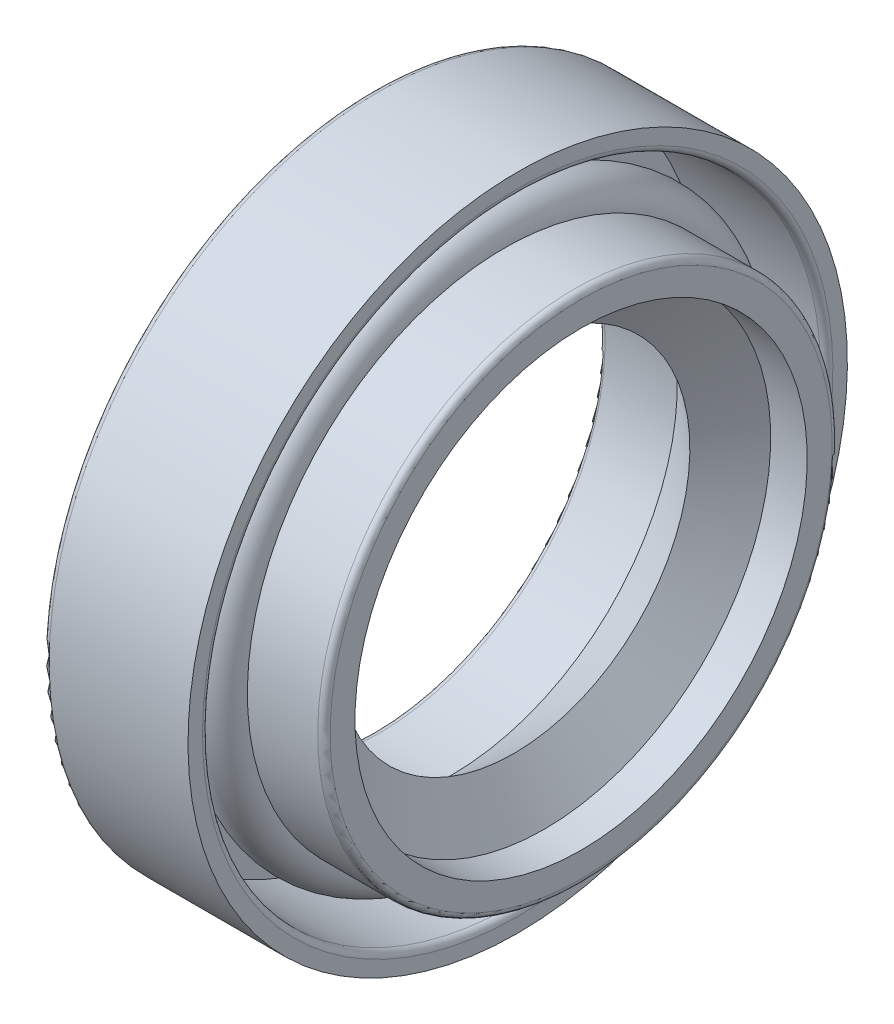
ISO-10303-21;
HEADER;
FILE_DESCRIPTION(('STEP AP214'),'2;1');
FILE_NAME('part.step','',(''),(''),'','','');
FILE_SCHEMA(('AUTOMOTIVE_DESIGN { 1 0 10303 214 1 1 1 1 }'));
ENDSEC;
DATA;
#1=APPLICATION_CONTEXT('core data for automotive mechanical design processes');
#2=APPLICATION_PROTOCOL_DEFINITION('international standard','automotive_design',2000,#1);
#3=PRODUCT_CONTEXT('',#1,'mechanical');
#4=PRODUCT('Part','Part','',(#3));
#5=PRODUCT_RELATED_PRODUCT_CATEGORY('part','',(#4));
#6=PRODUCT_DEFINITION_FORMATION('','',#4);
#7=PRODUCT_DEFINITION_CONTEXT('part definition',#1,'design');
#8=PRODUCT_DEFINITION('design','',#6,#7);
#9=PRODUCT_DEFINITION_SHAPE('','',#8);
#10=(LENGTH_UNIT() NAMED_UNIT(*) SI_UNIT(.MILLI.,.METRE.));
#11=(NAMED_UNIT(*) PLANE_ANGLE_UNIT() SI_UNIT($,.RADIAN.));
#12=(NAMED_UNIT(*) SI_UNIT($,.STERADIAN.) SOLID_ANGLE_UNIT());
#13=UNCERTAINTY_MEASURE_WITH_UNIT(LENGTH_MEASURE(1.E-05),#10,'distance_accuracy_value','');
#14=(GEOMETRIC_REPRESENTATION_CONTEXT(3) GLOBAL_UNCERTAINTY_ASSIGNED_CONTEXT((#13)) GLOBAL_UNIT_ASSIGNED_CONTEXT((#10,
#11,#12)) REPRESENTATION_CONTEXT('',''));
#15=CARTESIAN_POINT('',(0.,0.,0.));
#16=DIRECTION('',(0.,0.,1.));
#17=DIRECTION('',(1.,0.,0.));
#18=AXIS2_PLACEMENT_3D('',#15,#16,#17);
#19=CARTESIAN_POINT('',(3.79351798729761,0.,0.));
#20=DIRECTION('',(-1.,0.,0.));
#21=DIRECTION('',(0.,-1.,0.));
#22=AXIS2_PLACEMENT_3D('',#19,#20,#21);
#23=CONICAL_SURFACE('',#22,10.9140500939635,0.674740942223552);
#24=CARTESIAN_POINT('',(6.81108060475203,0.,0.));
#25=DIRECTION('',(-1.,0.,0.));
#26=DIRECTION('',(0.,-1.,0.));
#27=AXIS2_PLACEMENT_3D('',#24,#25,#26);
#28=CIRCLE('',#27,8.5);
#29=CARTESIAN_POINT('',(6.81108060475203,-8.5,0.));
#30=VERTEX_POINT('',#29);
#31=EDGE_CURVE('E10',#30,#30,#28,.T.);
#32=ORIENTED_EDGE('',*,*,#31,.F.);
#33=EDGE_LOOP('',(#32));
#34=FACE_BOUND('',#33,.T.);
#35=CARTESIAN_POINT('',(3.79351798729761,0.,0.));
#36=DIRECTION('',(-1.,0.,0.));
#37=DIRECTION('',(0.,-1.,0.));
#38=AXIS2_PLACEMENT_3D('',#35,#36,#37);
#39=CIRCLE('',#38,10.9140500939635);
#40=CARTESIAN_POINT('',(3.79351798729761,-10.9140500939635,0.));
#41=VERTEX_POINT('',#40);
#42=EDGE_CURVE('E92',#41,#41,#39,.T.);
#43=ORIENTED_EDGE('',*,*,#42,.T.);
#44=EDGE_LOOP('',(#43));
#45=FACE_BOUND('',#44,.T.);
#46=ADVANCED_FACE('F37',(#34,#45),#23,.F.);
#47=CARTESIAN_POINT('',(6.81108060475203,0.,0.));
#48=DIRECTION('',(1.,0.,0.));
#49=DIRECTION('',(0.,1.,0.));
#50=AXIS2_PLACEMENT_3D('',#47,#48,#49);
#51=CONICAL_SURFACE('',#50,8.5,1.01914134426635);
#52=CARTESIAN_POINT('',(8.29664989334498,0.,0.));
#53=DIRECTION('',(-1.,0.,0.));
#54=DIRECTION('',(0.,-1.,0.));
#55=AXIS2_PLACEMENT_3D('',#52,#53,#54);
#56=CIRCLE('',#55,10.9140500939635);
#57=CARTESIAN_POINT('',(8.29664989334498,-10.9140500939635,0.));
#58=VERTEX_POINT('',#57);
#59=EDGE_CURVE('E43',#58,#58,#56,.T.);
#60=ORIENTED_EDGE('',*,*,#59,.F.);
#61=EDGE_LOOP('',(#60));
#62=FACE_BOUND('',#61,.T.);
#63=ORIENTED_EDGE('',*,*,#31,.T.);
#64=EDGE_LOOP('',(#63));
#65=FACE_BOUND('',#64,.T.);
#66=ADVANCED_FACE('F183',(#62,#65),#51,.F.);
#67=CARTESIAN_POINT('',(0.,0.,0.));
#68=DIRECTION('',(-1.,0.,0.));
#69=DIRECTION('',(0.,-1.,0.));
#70=AXIS2_PLACEMENT_3D('',#67,#68,#69);
#71=CYLINDRICAL_SURFACE('',#70,10.9140500939635);
#72=CARTESIAN_POINT('',(10.0607634235491,0.,0.));
#73=DIRECTION('',(-1.,0.,0.));
#74=DIRECTION('',(0.,-1.,0.));
#75=AXIS2_PLACEMENT_3D('',#72,#73,#74);
#76=CIRCLE('',#75,10.9140500939635);
#77=CARTESIAN_POINT('',(10.0607634235491,-10.9140500939635,0.));
#78=VERTEX_POINT('',#77);
#79=EDGE_CURVE('E47',#78,#78,#76,.T.);
#80=ORIENTED_EDGE('',*,*,#79,.F.);
#81=EDGE_LOOP('',(#80));
#82=FACE_BOUND('',#81,.T.);
#83=ORIENTED_EDGE('',*,*,#59,.T.);
#84=EDGE_LOOP('',(#83));
#85=FACE_BOUND('',#84,.T.);
#86=ADVANCED_FACE('F178',(#82,#85),#71,.F.);
#87=CARTESIAN_POINT('',(10.0607634235491,10.9140500939635,0.));
#88=DIRECTION('',(-1.,0.,0.));
#89=DIRECTION('',(0.,-1.,0.));
#90=AXIS2_PLACEMENT_3D('',#87,#88,#89);
#91=PLANE('',#90);
#92=CARTESIAN_POINT('',(10.0607634235491,0.,0.));
#93=DIRECTION('',(-1.,0.,0.));
#94=DIRECTION('',(0.,-1.,0.));
#95=AXIS2_PLACEMENT_3D('',#92,#93,#94);
#96=CIRCLE('',#95,12.1140500939635);
#97=CARTESIAN_POINT('',(10.0607634235491,-12.1140500939635,0.));
#98=VERTEX_POINT('',#97);
#99=EDGE_CURVE('E51',#98,#98,#96,.T.);
#100=ORIENTED_EDGE('',*,*,#99,.F.);
#101=EDGE_LOOP('',(#100));
#102=FACE_BOUND('',#101,.T.);
#103=ORIENTED_EDGE('',*,*,#79,.T.);
#104=EDGE_LOOP('',(#103));
#105=FACE_BOUND('',#104,.T.);
#106=ADVANCED_FACE('F172',(#102,#105),#91,.F.);
#107=CARTESIAN_POINT('',(9.76076342354911,0.,0.));
#108=DIRECTION('',(-1.,0.,0.));
#109=DIRECTION('',(0.,-1.,0.));
#110=AXIS2_PLACEMENT_3D('',#107,#108,#109);
#111=TOROIDAL_SURFACE('',#110,12.1140500939635,0.3);
#112=CARTESIAN_POINT('',(9.7607634235491,0.,0.));
#113=DIRECTION('',(-1.,0.,0.));
#114=DIRECTION('',(0.,-1.,0.));
#115=AXIS2_PLACEMENT_3D('',#112,#113,#114);
#116=CIRCLE('',#115,12.4140500939635);
#117=CARTESIAN_POINT('',(9.7607634235491,-12.4140500939635,0.));
#118=VERTEX_POINT('',#117);
#119=EDGE_CURVE('E56',#118,#118,#116,.T.);
#120=ORIENTED_EDGE('',*,*,#119,.F.);
#121=EDGE_LOOP('',(#120));
#122=FACE_BOUND('',#121,.T.);
#123=ORIENTED_EDGE('',*,*,#99,.T.);
#124=EDGE_LOOP('',(#123));
#125=FACE_BOUND('',#124,.T.);
#126=ADVANCED_FACE('F166',(#122,#125),#111,.T.);
#127=CARTESIAN_POINT('',(0.,0.,0.));
#128=DIRECTION('',(-1.,0.,0.));
#129=DIRECTION('',(0.,-1.,0.));
#130=AXIS2_PLACEMENT_3D('',#127,#128,#129);
#131=CYLINDRICAL_SURFACE('',#130,12.4140500939635);
#132=CARTESIAN_POINT('',(6.36550708989647,0.,0.));
#133=DIRECTION('',(-1.,0.,0.));
#134=DIRECTION('',(0.,-1.,0.));
#135=AXIS2_PLACEMENT_3D('',#132,#133,#134);
#136=CIRCLE('',#135,12.4140500939635);
#137=CARTESIAN_POINT('',(6.36550708989647,-12.4140500939635,0.));
#138=VERTEX_POINT('',#137);
#139=EDGE_CURVE('E59',#138,#138,#136,.T.);
#140=ORIENTED_EDGE('',*,*,#139,.F.);
#141=EDGE_LOOP('',(#140));
#142=FACE_BOUND('',#141,.T.);
#143=ORIENTED_EDGE('',*,*,#119,.T.);
#144=EDGE_LOOP('',(#143));
#145=FACE_BOUND('',#144,.T.);
#146=ADVANCED_FACE('F160',(#142,#145),#131,.T.);
#147=CARTESIAN_POINT('',(5.07951253859704,0.,0.));
#148=DIRECTION('',(-1.,0.,0.));
#149=DIRECTION('',(0.,-1.,0.));
#150=AXIS2_PLACEMENT_3D('',#147,#148,#149);
#151=TOROIDAL_SURFACE('',#150,12.4140500939635,1.28599455129943);
#152=CARTESIAN_POINT('',(3.79351798729761,0.,0.));
#153=DIRECTION('',(-1.,0.,0.));
#154=DIRECTION('',(0.,-1.,0.));
#155=AXIS2_PLACEMENT_3D('',#152,#153,#154);
#156=CIRCLE('',#155,12.4140500939635);
#157=CARTESIAN_POINT('',(3.79351798729761,-12.4140500939635,0.));
#158=VERTEX_POINT('',#157);
#159=EDGE_CURVE('E62',#158,#158,#156,.T.);
#160=ORIENTED_EDGE('',*,*,#159,.F.);
#161=EDGE_LOOP('',(#160));
#162=FACE_BOUND('',#161,.T.);
#163=ORIENTED_EDGE('',*,*,#139,.T.);
#164=EDGE_LOOP('',(#163));
#165=FACE_BOUND('',#164,.T.);
#166=ADVANCED_FACE('F154',(#162,#165),#151,.T.);
#167=CARTESIAN_POINT('',(0.,0.,0.));
#168=DIRECTION('',(-1.,0.,0.));
#169=DIRECTION('',(0.,-1.,0.));
#170=AXIS2_PLACEMENT_3D('',#167,#168,#169);
#171=CYLINDRICAL_SURFACE('',#170,12.4140500939635);
#172=CARTESIAN_POINT('',(1.,0.,0.));
#173=DIRECTION('',(-1.,0.,0.));
#174=DIRECTION('',(0.,-1.,0.));
#175=AXIS2_PLACEMENT_3D('',#172,#173,#174);
#176=CIRCLE('',#175,12.4140500939635);
#177=CARTESIAN_POINT('',(1.,-12.4140500939635,0.));
#178=VERTEX_POINT('',#177);
#179=EDGE_CURVE('E65',#178,#178,#176,.T.);
#180=ORIENTED_EDGE('',*,*,#179,.F.);
#181=EDGE_LOOP('',(#180));
#182=FACE_BOUND('',#181,.T.);
#183=ORIENTED_EDGE('',*,*,#159,.T.);
#184=EDGE_LOOP('',(#183));
#185=FACE_BOUND('',#184,.T.);
#186=ADVANCED_FACE('F148',(#182,#185),#171,.T.);
#187=CARTESIAN_POINT('',(1.,12.4140500939635,0.));
#188=DIRECTION('',(-1.,0.,0.));
#189=DIRECTION('',(0.,-1.,0.));
#190=AXIS2_PLACEMENT_3D('',#187,#188,#189);
#191=PLANE('',#190);
#192=CARTESIAN_POINT('',(1.,0.,0.));
#193=DIRECTION('',(-1.,0.,0.));
#194=DIRECTION('',(0.,-1.,0.));
#195=AXIS2_PLACEMENT_3D('',#192,#193,#194);
#196=CIRCLE('',#195,14.9140500939635);
#197=CARTESIAN_POINT('',(1.,-14.9140500939635,0.));
#198=VERTEX_POINT('',#197);
#199=EDGE_CURVE('E68',#198,#198,#196,.T.);
#200=ORIENTED_EDGE('',*,*,#199,.F.);
#201=EDGE_LOOP('',(#200));
#202=FACE_BOUND('',#201,.T.);
#203=ORIENTED_EDGE('',*,*,#179,.T.);
#204=EDGE_LOOP('',(#203));
#205=FACE_BOUND('',#204,.T.);
#206=ADVANCED_FACE('F142',(#202,#205),#191,.F.);
#207=CARTESIAN_POINT('',(0.,0.,0.));
#208=DIRECTION('',(-1.,0.,0.));
#209=DIRECTION('',(0.,-1.,0.));
#210=AXIS2_PLACEMENT_3D('',#207,#208,#209);
#211=CYLINDRICAL_SURFACE('',#210,14.9140500939635);
#212=CARTESIAN_POINT('',(6.7,0.,0.));
#213=DIRECTION('',(-1.,0.,0.));
#214=DIRECTION('',(0.,-1.,0.));
#215=AXIS2_PLACEMENT_3D('',#212,#213,#214);
#216=CIRCLE('',#215,14.9140500939635);
#217=CARTESIAN_POINT('',(6.7,-14.9140500939635,0.));
#218=VERTEX_POINT('',#217);
#219=EDGE_CURVE('E71',#218,#218,#216,.T.);
#220=ORIENTED_EDGE('',*,*,#219,.F.);
#221=EDGE_LOOP('',(#220));
#222=FACE_BOUND('',#221,.T.);
#223=ORIENTED_EDGE('',*,*,#199,.T.);
#224=EDGE_LOOP('',(#223));
#225=FACE_BOUND('',#224,.T.);
#226=ADVANCED_FACE('F136',(#222,#225),#211,.F.);
#227=CARTESIAN_POINT('',(6.7,0.,0.));
#228=DIRECTION('',(-1.,0.,0.));
#229=DIRECTION('',(0.,-1.,0.));
#230=AXIS2_PLACEMENT_3D('',#227,#228,#229);
#231=TOROIDAL_SURFACE('',#230,15.2140500939635,0.3);
#232=CARTESIAN_POINT('',(7.,0.,0.));
#233=DIRECTION('',(-1.,0.,0.));
#234=DIRECTION('',(0.,-1.,0.));
#235=AXIS2_PLACEMENT_3D('',#232,#233,#234);
#236=CIRCLE('',#235,15.2140500939635);
#237=CARTESIAN_POINT('',(7.,-15.2140500939635,0.));
#238=VERTEX_POINT('',#237);
#239=EDGE_CURVE('E74',#238,#238,#236,.T.);
#240=ORIENTED_EDGE('',*,*,#239,.F.);
#241=EDGE_LOOP('',(#240));
#242=FACE_BOUND('',#241,.T.);
#243=ORIENTED_EDGE('',*,*,#219,.T.);
#244=EDGE_LOOP('',(#243));
#245=FACE_BOUND('',#244,.T.);
#246=ADVANCED_FACE('F130',(#242,#245),#231,.T.);
#247=CARTESIAN_POINT('',(7.,15.2140500939635,0.));
#248=DIRECTION('',(-1.,0.,0.));
#249=DIRECTION('',(0.,-1.,0.));
#250=AXIS2_PLACEMENT_3D('',#247,#248,#249);
#251=PLANE('',#250);
#252=CARTESIAN_POINT('',(7.,0.,0.));
#253=DIRECTION('',(-1.,0.,0.));
#254=DIRECTION('',(0.,-1.,0.));
#255=AXIS2_PLACEMENT_3D('',#252,#253,#254);
#256=CIRCLE('',#255,15.9140500939635);
#257=CARTESIAN_POINT('',(7.,-15.9140500939635,0.));
#258=VERTEX_POINT('',#257);
#259=EDGE_CURVE('E77',#258,#258,#256,.T.);
#260=ORIENTED_EDGE('',*,*,#259,.F.);
#261=EDGE_LOOP('',(#260));
#262=FACE_BOUND('',#261,.T.);
#263=ORIENTED_EDGE('',*,*,#239,.T.);
#264=EDGE_LOOP('',(#263));
#265=FACE_BOUND('',#264,.T.);
#266=ADVANCED_FACE('F124',(#262,#265),#251,.F.);
#267=CARTESIAN_POINT('',(0.,0.,0.));
#268=DIRECTION('',(-1.,0.,0.));
#269=DIRECTION('',(0.,-1.,0.));
#270=AXIS2_PLACEMENT_3D('',#267,#268,#269);
#271=CYLINDRICAL_SURFACE('',#270,15.9140500939635);
#272=CARTESIAN_POINT('',(0.300000000000002,0.,0.));
#273=DIRECTION('',(-1.,0.,0.));
#274=DIRECTION('',(0.,-1.,0.));
#275=AXIS2_PLACEMENT_3D('',#272,#273,#274);
#276=CIRCLE('',#275,15.9140500939635);
#277=CARTESIAN_POINT('',(0.300000000000002,-15.9140500939635,0.));
#278=VERTEX_POINT('',#277);
#279=EDGE_CURVE('E80',#278,#278,#276,.T.);
#280=ORIENTED_EDGE('',*,*,#279,.F.);
#281=EDGE_LOOP('',(#280));
#282=FACE_BOUND('',#281,.T.);
#283=ORIENTED_EDGE('',*,*,#259,.T.);
#284=EDGE_LOOP('',(#283));
#285=FACE_BOUND('',#284,.T.);
#286=ADVANCED_FACE('F118',(#282,#285),#271,.T.);
#287=CARTESIAN_POINT('',(0.3,0.,0.));
#288=DIRECTION('',(-1.,0.,0.));
#289=DIRECTION('',(0.,-1.,0.));
#290=AXIS2_PLACEMENT_3D('',#287,#288,#289);
#291=TOROIDAL_SURFACE('',#290,15.6140500939635,0.3);
#292=CARTESIAN_POINT('',(0.,0.,0.));
#293=DIRECTION('',(-1.,0.,0.));
#294=DIRECTION('',(0.,-1.,0.));
#295=AXIS2_PLACEMENT_3D('',#292,#293,#294);
#296=CIRCLE('',#295,15.6140500939635);
#297=CARTESIAN_POINT('',(0.,-15.6140500939635,0.));
#298=VERTEX_POINT('',#297);
#299=EDGE_CURVE('E83',#298,#298,#296,.T.);
#300=ORIENTED_EDGE('',*,*,#299,.F.);
#301=EDGE_LOOP('',(#300));
#302=FACE_BOUND('',#301,.T.);
#303=ORIENTED_EDGE('',*,*,#279,.T.);
#304=EDGE_LOOP('',(#303));
#305=FACE_BOUND('',#304,.T.);
#306=ADVANCED_FACE('F112',(#302,#305),#291,.T.);
#307=CARTESIAN_POINT('',(0.,15.6140500939635,0.));
#308=DIRECTION('',(1.,0.,0.));
#309=DIRECTION('',(0.,1.,0.));
#310=AXIS2_PLACEMENT_3D('',#307,#308,#309);
#311=PLANE('',#310);
#312=CARTESIAN_POINT('',(0.,0.,0.));
#313=DIRECTION('',(-1.,0.,0.));
#314=DIRECTION('',(0.,-1.,0.));
#315=AXIS2_PLACEMENT_3D('',#312,#313,#314);
#316=CIRCLE('',#315,11.2140500939635);
#317=CARTESIAN_POINT('',(0.,-11.2140500939635,0.));
#318=VERTEX_POINT('',#317);
#319=EDGE_CURVE('E86',#318,#318,#316,.T.);
#320=ORIENTED_EDGE('',*,*,#319,.F.);
#321=EDGE_LOOP('',(#320));
#322=FACE_BOUND('',#321,.T.);
#323=ORIENTED_EDGE('',*,*,#299,.T.);
#324=EDGE_LOOP('',(#323));
#325=FACE_BOUND('',#324,.T.);
#326=ADVANCED_FACE('F106',(#322,#325),#311,.F.);
#327=CARTESIAN_POINT('',(0.3,0.,0.));
#328=DIRECTION('',(-1.,0.,0.));
#329=DIRECTION('',(0.,-1.,0.));
#330=AXIS2_PLACEMENT_3D('',#327,#328,#329);
#331=TOROIDAL_SURFACE('',#330,11.2140500939635,0.3);
#332=CARTESIAN_POINT('',(0.300000000000002,0.,0.));
#333=DIRECTION('',(-1.,0.,0.));
#334=DIRECTION('',(0.,-1.,0.));
#335=AXIS2_PLACEMENT_3D('',#332,#333,#334);
#336=CIRCLE('',#335,10.9140500939635);
#337=CARTESIAN_POINT('',(0.300000000000002,-10.9140500939635,0.));
#338=VERTEX_POINT('',#337);
#339=EDGE_CURVE('E89',#338,#338,#336,.T.);
#340=ORIENTED_EDGE('',*,*,#339,.F.);
#341=EDGE_LOOP('',(#340));
#342=FACE_BOUND('',#341,.T.);
#343=ORIENTED_EDGE('',*,*,#319,.T.);
#344=EDGE_LOOP('',(#343));
#345=FACE_BOUND('',#344,.T.);
#346=ADVANCED_FACE('F100',(#342,#345),#331,.T.);
#347=CARTESIAN_POINT('',(0.,0.,0.));
#348=DIRECTION('',(-1.,0.,0.));
#349=DIRECTION('',(0.,-1.,0.));
#350=AXIS2_PLACEMENT_3D('',#347,#348,#349);
#351=CYLINDRICAL_SURFACE('',#350,10.9140500939635);
#352=ORIENTED_EDGE('',*,*,#42,.F.);
#353=EDGE_LOOP('',(#352));
#354=FACE_BOUND('',#353,.T.);
#355=ORIENTED_EDGE('',*,*,#339,.T.);
#356=EDGE_LOOP('',(#355));
#357=FACE_BOUND('',#356,.T.);
#358=ADVANCED_FACE('F97',(#354,#357),#351,.F.);
#359=CLOSED_SHELL('',(#46,#66,#86,#106,#126,#146,#166,#186,#206,#226,#246,#266,#286,#306,#326,
#346,#358));
#360=MANIFOLD_SOLID_BREP('B2',#359);
#361=ADVANCED_BREP_SHAPE_REPRESENTATION('',(#18,#360),#14);
#362=SHAPE_DEFINITION_REPRESENTATION(#9,#361);
ENDSEC;
END-ISO-10303-21;
